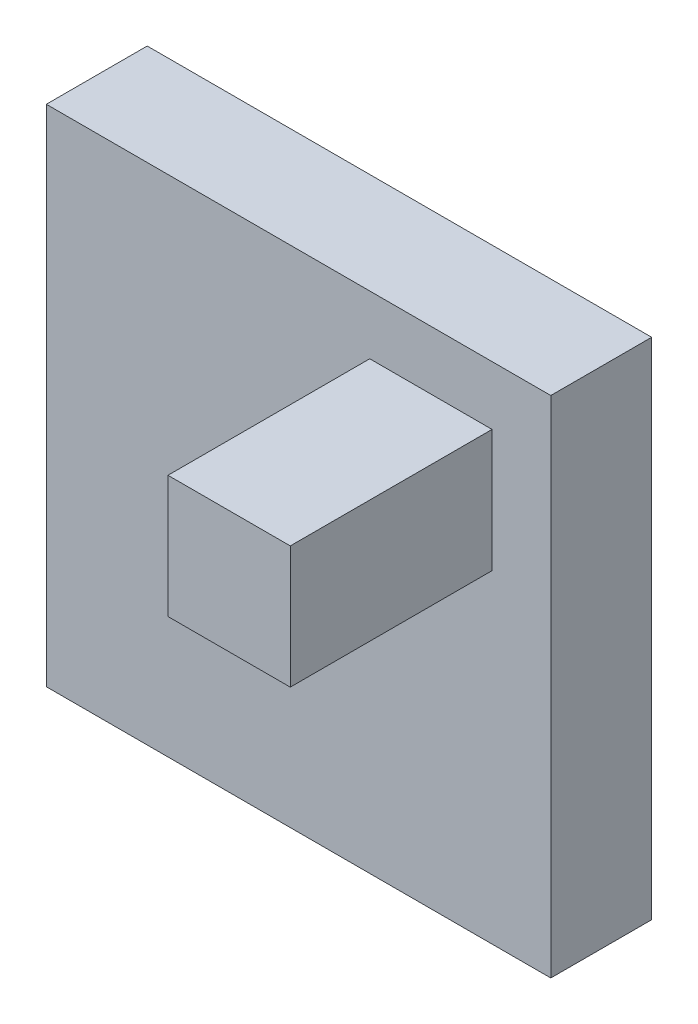
ISO-10303-21;
HEADER;
FILE_DESCRIPTION(('STEP AP214'),'2;1');
FILE_NAME('part.step','',(''),(''),'','','');
FILE_SCHEMA(('AUTOMOTIVE_DESIGN { 1 0 10303 214 1 1 1 1 }'));
ENDSEC;
DATA;
#1=APPLICATION_CONTEXT('core data for automotive mechanical design processes');
#2=APPLICATION_PROTOCOL_DEFINITION('international standard','automotive_design',2000,#1);
#3=PRODUCT_CONTEXT('',#1,'mechanical');
#4=PRODUCT('Part','Part','',(#3));
#5=PRODUCT_RELATED_PRODUCT_CATEGORY('part','',(#4));
#6=PRODUCT_DEFINITION_FORMATION('','',#4);
#7=PRODUCT_DEFINITION_CONTEXT('part definition',#1,'design');
#8=PRODUCT_DEFINITION('design','',#6,#7);
#9=PRODUCT_DEFINITION_SHAPE('','',#8);
#10=(LENGTH_UNIT() NAMED_UNIT(*) SI_UNIT(.MILLI.,.METRE.));
#11=(NAMED_UNIT(*) PLANE_ANGLE_UNIT() SI_UNIT($,.RADIAN.));
#12=(NAMED_UNIT(*) SI_UNIT($,.STERADIAN.) SOLID_ANGLE_UNIT());
#13=UNCERTAINTY_MEASURE_WITH_UNIT(LENGTH_MEASURE(1.E-05),#10,'distance_accuracy_value','');
#14=(GEOMETRIC_REPRESENTATION_CONTEXT(3) GLOBAL_UNCERTAINTY_ASSIGNED_CONTEXT((#13)) GLOBAL_UNIT_ASSIGNED_CONTEXT((#10,
#11,#12)) REPRESENTATION_CONTEXT('',''));
#15=CARTESIAN_POINT('',(0.,0.,0.));
#16=DIRECTION('',(0.,0.,1.));
#17=DIRECTION('',(1.,0.,0.));
#18=AXIS2_PLACEMENT_3D('',#15,#16,#17);
#19=CARTESIAN_POINT('',(0.,0.,2.));
#20=DIRECTION('',(0.,0.,1.));
#21=DIRECTION('',(1.,0.,0.));
#22=AXIS2_PLACEMENT_3D('',#19,#20,#21);
#23=PLANE('',#22);
#24=DIRECTION('',(0.,-1.,0.));
#25=VECTOR('',#24,1.);
#26=CARTESIAN_POINT('',(0.,0.,2.));
#27=LINE('',#26,#25);
#28=CARTESIAN_POINT('',(0.,0.,2.));
#29=VERTEX_POINT('',#28);
#30=CARTESIAN_POINT('',(0.,-10.,2.));
#31=VERTEX_POINT('',#30);
#32=EDGE_CURVE('E156',#29,#31,#27,.T.);
#33=ORIENTED_EDGE('',*,*,#32,.T.);
#34=DIRECTION('',(1.,0.,0.));
#35=VECTOR('',#34,1.);
#36=CARTESIAN_POINT('',(0.,-10.,2.));
#37=LINE('',#36,#35);
#38=CARTESIAN_POINT('',(10.,-10.,2.));
#39=VERTEX_POINT('',#38);
#40=EDGE_CURVE('E96',#31,#39,#37,.T.);
#41=ORIENTED_EDGE('',*,*,#40,.T.);
#42=DIRECTION('',(0.,1.,0.));
#43=VECTOR('',#42,1.);
#44=CARTESIAN_POINT('',(10.,0.,2.));
#45=LINE('',#44,#43);
#46=CARTESIAN_POINT('',(10.,0.,2.));
#47=VERTEX_POINT('',#46);
#48=EDGE_CURVE('E161',#39,#47,#45,.T.);
#49=ORIENTED_EDGE('',*,*,#48,.T.);
#50=DIRECTION('',(-1.,0.,0.));
#51=VECTOR('',#50,1.);
#52=CARTESIAN_POINT('',(0.,0.,2.));
#53=LINE('',#52,#51);
#54=EDGE_CURVE('E68',#47,#29,#53,.T.);
#55=ORIENTED_EDGE('',*,*,#54,.T.);
#56=EDGE_LOOP('',(#33,#41,#49,#55));
#57=FACE_BOUND('',#56,.T.);
#58=DIRECTION('',(1.,0.,0.));
#59=VECTOR('',#58,1.);
#60=CARTESIAN_POINT('',(6.41133202771353,-3.58866797228647,2.));
#61=LINE('',#60,#59);
#62=CARTESIAN_POINT('',(6.41133202771353,-3.58866797228647,2.));
#63=VERTEX_POINT('',#62);
#64=CARTESIAN_POINT('',(8.8360641204394,-3.58866797228647,2.));
#65=VERTEX_POINT('',#64);
#66=EDGE_CURVE('E313',#63,#65,#61,.T.);
#67=ORIENTED_EDGE('',*,*,#66,.F.);
#68=DIRECTION('',(0.,-1.,0.));
#69=VECTOR('',#68,1.);
#70=CARTESIAN_POINT('',(6.41133202771353,-1.16393587956059,2.));
#71=LINE('',#70,#69);
#72=CARTESIAN_POINT('',(6.41133202771353,-1.16393587956059,2.));
#73=VERTEX_POINT('',#72);
#74=EDGE_CURVE('E143',#73,#63,#71,.T.);
#75=ORIENTED_EDGE('',*,*,#74,.F.);
#76=DIRECTION('',(-1.,0.,0.));
#77=VECTOR('',#76,1.);
#78=CARTESIAN_POINT('',(6.41133202771353,-1.16393587956059,2.));
#79=LINE('',#78,#77);
#80=CARTESIAN_POINT('',(8.8360641204394,-1.16393587956059,2.));
#81=VERTEX_POINT('',#80);
#82=EDGE_CURVE('E139',#81,#73,#79,.T.);
#83=ORIENTED_EDGE('',*,*,#82,.F.);
#84=DIRECTION('',(0.,1.,0.));
#85=VECTOR('',#84,1.);
#86=CARTESIAN_POINT('',(8.8360641204394,-1.16393587956059,2.));
#87=LINE('',#86,#85);
#88=EDGE_CURVE('E309',#65,#81,#87,.T.);
#89=ORIENTED_EDGE('',*,*,#88,.F.);
#90=EDGE_LOOP('',(#67,#75,#83,#89));
#91=FACE_BOUND('',#90,.T.);
#92=ADVANCED_FACE('F43',(#57,#91),#23,.T.);
#93=CARTESIAN_POINT('',(0.,0.,2.));
#94=DIRECTION('',(1.,0.,0.));
#95=DIRECTION('',(0.,0.,-1.));
#96=AXIS2_PLACEMENT_3D('',#93,#94,#95);
#97=PLANE('',#96);
#98=DIRECTION('',(0.,-1.,0.));
#99=VECTOR('',#98,1.);
#100=CARTESIAN_POINT('',(0.,0.,0.));
#101=LINE('',#100,#99);
#102=CARTESIAN_POINT('',(0.,0.,0.));
#103=VERTEX_POINT('',#102);
#104=CARTESIAN_POINT('',(0.,-10.,0.));
#105=VERTEX_POINT('',#104);
#106=EDGE_CURVE('E146',#103,#105,#101,.T.);
#107=ORIENTED_EDGE('',*,*,#106,.T.);
#108=DIRECTION('',(0.,0.,-1.));
#109=VECTOR('',#108,1.);
#110=CARTESIAN_POINT('',(0.,-10.,2.));
#111=LINE('',#110,#109);
#112=EDGE_CURVE('E11',#31,#105,#111,.T.);
#113=ORIENTED_EDGE('',*,*,#112,.F.);
#114=ORIENTED_EDGE('',*,*,#32,.F.);
#115=DIRECTION('',(0.,0.,-1.));
#116=VECTOR('',#115,1.);
#117=CARTESIAN_POINT('',(0.,0.,2.));
#118=LINE('',#117,#116);
#119=EDGE_CURVE('E165',#29,#103,#118,.T.);
#120=ORIENTED_EDGE('',*,*,#119,.T.);
#121=EDGE_LOOP('',(#107,#113,#114,#120));
#122=FACE_BOUND('',#121,.T.);
#123=ADVANCED_FACE('F45',(#122),#97,.F.);
#124=CARTESIAN_POINT('',(0.,-10.,2.));
#125=DIRECTION('',(0.,1.,0.));
#126=DIRECTION('',(0.,0.,1.));
#127=AXIS2_PLACEMENT_3D('',#124,#125,#126);
#128=PLANE('',#127);
#129=DIRECTION('',(1.,0.,0.));
#130=VECTOR('',#129,1.);
#131=CARTESIAN_POINT('',(0.,-10.,0.));
#132=LINE('',#131,#130);
#133=CARTESIAN_POINT('',(10.,-10.,0.));
#134=VERTEX_POINT('',#133);
#135=EDGE_CURVE('E151',#105,#134,#132,.T.);
#136=ORIENTED_EDGE('',*,*,#135,.T.);
#137=DIRECTION('',(0.,0.,-1.));
#138=VECTOR('',#137,1.);
#139=CARTESIAN_POINT('',(10.,-10.,2.));
#140=LINE('',#139,#138);
#141=EDGE_CURVE('E52',#39,#134,#140,.T.);
#142=ORIENTED_EDGE('',*,*,#141,.F.);
#143=ORIENTED_EDGE('',*,*,#40,.F.);
#144=ORIENTED_EDGE('',*,*,#112,.T.);
#145=EDGE_LOOP('',(#136,#142,#143,#144));
#146=FACE_BOUND('',#145,.T.);
#147=ADVANCED_FACE('F199',(#146),#128,.F.);
#148=CARTESIAN_POINT('',(10.,0.,2.));
#149=DIRECTION('',(-1.,0.,0.));
#150=DIRECTION('',(0.,0.,1.));
#151=AXIS2_PLACEMENT_3D('',#148,#149,#150);
#152=PLANE('',#151);
#153=DIRECTION('',(0.,1.,0.));
#154=VECTOR('',#153,1.);
#155=CARTESIAN_POINT('',(10.,0.,0.));
#156=LINE('',#155,#154);
#157=CARTESIAN_POINT('',(10.,0.,0.));
#158=VERTEX_POINT('',#157);
#159=EDGE_CURVE('E169',#134,#158,#156,.T.);
#160=ORIENTED_EDGE('',*,*,#159,.T.);
#161=DIRECTION('',(0.,0.,-1.));
#162=VECTOR('',#161,1.);
#163=CARTESIAN_POINT('',(10.,0.,2.));
#164=LINE('',#163,#162);
#165=EDGE_CURVE('E176',#47,#158,#164,.T.);
#166=ORIENTED_EDGE('',*,*,#165,.F.);
#167=ORIENTED_EDGE('',*,*,#48,.F.);
#168=ORIENTED_EDGE('',*,*,#141,.T.);
#169=EDGE_LOOP('',(#160,#166,#167,#168));
#170=FACE_BOUND('',#169,.T.);
#171=ADVANCED_FACE('F183',(#170),#152,.F.);
#172=CARTESIAN_POINT('',(0.,0.,2.));
#173=DIRECTION('',(0.,-1.,0.));
#174=DIRECTION('',(0.,0.,-1.));
#175=AXIS2_PLACEMENT_3D('',#172,#173,#174);
#176=PLANE('',#175);
#177=DIRECTION('',(-1.,0.,0.));
#178=VECTOR('',#177,1.);
#179=CARTESIAN_POINT('',(0.,0.,0.));
#180=LINE('',#179,#178);
#181=EDGE_CURVE('E89',#158,#103,#180,.T.);
#182=ORIENTED_EDGE('',*,*,#181,.T.);
#183=ORIENTED_EDGE('',*,*,#119,.F.);
#184=ORIENTED_EDGE('',*,*,#54,.F.);
#185=ORIENTED_EDGE('',*,*,#165,.T.);
#186=EDGE_LOOP('',(#182,#183,#184,#185));
#187=FACE_BOUND('',#186,.T.);
#188=ADVANCED_FACE('F191',(#187),#176,.F.);
#189=CARTESIAN_POINT('',(0.,0.,0.));
#190=DIRECTION('',(0.,0.,1.));
#191=DIRECTION('',(1.,0.,0.));
#192=AXIS2_PLACEMENT_3D('',#189,#190,#191);
#193=PLANE('',#192);
#194=ORIENTED_EDGE('',*,*,#106,.F.);
#195=ORIENTED_EDGE('',*,*,#181,.F.);
#196=ORIENTED_EDGE('',*,*,#159,.F.);
#197=ORIENTED_EDGE('',*,*,#135,.F.);
#198=EDGE_LOOP('',(#194,#195,#196,#197));
#199=FACE_BOUND('',#198,.T.);
#200=ADVANCED_FACE('F187',(#199),#193,.F.);
#201=CARTESIAN_POINT('',(6.41133202771353,-1.16393587956059,6.));
#202=DIRECTION('',(1.,0.,0.));
#203=DIRECTION('',(0.,1.,0.));
#204=AXIS2_PLACEMENT_3D('',#201,#202,#203);
#205=PLANE('',#204);
#206=ORIENTED_EDGE('',*,*,#74,.T.);
#207=DIRECTION('',(0.,0.,-1.));
#208=VECTOR('',#207,1.);
#209=CARTESIAN_POINT('',(6.41133202771353,-3.58866797228647,6.));
#210=LINE('',#209,#208);
#211=CARTESIAN_POINT('',(6.41133202771353,-3.58866797228647,6.));
#212=VERTEX_POINT('',#211);
#213=EDGE_CURVE('E122',#212,#63,#210,.T.);
#214=ORIENTED_EDGE('',*,*,#213,.F.);
#215=DIRECTION('',(0.,-1.,0.));
#216=VECTOR('',#215,1.);
#217=CARTESIAN_POINT('',(6.41133202771353,-1.16393587956059,6.));
#218=LINE('',#217,#216);
#219=CARTESIAN_POINT('',(6.41133202771353,-1.16393587956059,6.));
#220=VERTEX_POINT('',#219);
#221=EDGE_CURVE('E130',#220,#212,#218,.T.);
#222=ORIENTED_EDGE('',*,*,#221,.F.);
#223=DIRECTION('',(0.,0.,-1.));
#224=VECTOR('',#223,1.);
#225=CARTESIAN_POINT('',(6.41133202771353,-1.16393587956059,6.));
#226=LINE('',#225,#224);
#227=EDGE_CURVE('E306',#220,#73,#226,.T.);
#228=ORIENTED_EDGE('',*,*,#227,.T.);
#229=EDGE_LOOP('',(#206,#214,#222,#228));
#230=FACE_BOUND('',#229,.T.);
#231=ADVANCED_FACE('F141',(#230),#205,.F.);
#232=CARTESIAN_POINT('',(6.41133202771353,-3.58866797228647,6.));
#233=DIRECTION('',(0.,1.,0.));
#234=DIRECTION('',(0.,0.,1.));
#235=AXIS2_PLACEMENT_3D('',#232,#233,#234);
#236=PLANE('',#235);
#237=ORIENTED_EDGE('',*,*,#66,.T.);
#238=DIRECTION('',(0.,0.,-1.));
#239=VECTOR('',#238,1.);
#240=CARTESIAN_POINT('',(8.8360641204394,-3.58866797228647,6.));
#241=LINE('',#240,#239);
#242=CARTESIAN_POINT('',(8.8360641204394,-3.58866797228647,6.));
#243=VERTEX_POINT('',#242);
#244=EDGE_CURVE('E125',#243,#65,#241,.T.);
#245=ORIENTED_EDGE('',*,*,#244,.F.);
#246=DIRECTION('',(1.,0.,0.));
#247=VECTOR('',#246,1.);
#248=CARTESIAN_POINT('',(6.41133202771353,-3.58866797228647,6.));
#249=LINE('',#248,#247);
#250=EDGE_CURVE('E118',#212,#243,#249,.T.);
#251=ORIENTED_EDGE('',*,*,#250,.F.);
#252=ORIENTED_EDGE('',*,*,#213,.T.);
#253=EDGE_LOOP('',(#237,#245,#251,#252));
#254=FACE_BOUND('',#253,.T.);
#255=ADVANCED_FACE('F120',(#254),#236,.F.);
#256=CARTESIAN_POINT('',(8.8360641204394,-1.16393587956059,6.));
#257=DIRECTION('',(-1.,0.,0.));
#258=DIRECTION('',(0.,0.,1.));
#259=AXIS2_PLACEMENT_3D('',#256,#257,#258);
#260=PLANE('',#259);
#261=ORIENTED_EDGE('',*,*,#88,.T.);
#262=DIRECTION('',(0.,0.,-1.));
#263=VECTOR('',#262,1.);
#264=CARTESIAN_POINT('',(8.8360641204394,-1.16393587956059,6.));
#265=LINE('',#264,#263);
#266=CARTESIAN_POINT('',(8.8360641204394,-1.16393587956059,6.));
#267=VERTEX_POINT('',#266);
#268=EDGE_CURVE('E59',#267,#81,#265,.T.);
#269=ORIENTED_EDGE('',*,*,#268,.F.);
#270=DIRECTION('',(0.,1.,0.));
#271=VECTOR('',#270,1.);
#272=CARTESIAN_POINT('',(8.8360641204394,-1.16393587956059,6.));
#273=LINE('',#272,#271);
#274=EDGE_CURVE('E129',#243,#267,#273,.T.);
#275=ORIENTED_EDGE('',*,*,#274,.F.);
#276=ORIENTED_EDGE('',*,*,#244,.T.);
#277=EDGE_LOOP('',(#261,#269,#275,#276));
#278=FACE_BOUND('',#277,.T.);
#279=ADVANCED_FACE('F212',(#278),#260,.F.);
#280=CARTESIAN_POINT('',(6.41133202771353,-1.16393587956059,6.));
#281=DIRECTION('',(0.,-1.,0.));
#282=DIRECTION('',(0.,0.,-1.));
#283=AXIS2_PLACEMENT_3D('',#280,#281,#282);
#284=PLANE('',#283);
#285=ORIENTED_EDGE('',*,*,#82,.T.);
#286=ORIENTED_EDGE('',*,*,#227,.F.);
#287=DIRECTION('',(-1.,0.,0.));
#288=VECTOR('',#287,1.);
#289=CARTESIAN_POINT('',(6.41133202771353,-1.16393587956059,6.));
#290=LINE('',#289,#288);
#291=EDGE_CURVE('E134',#267,#220,#290,.T.);
#292=ORIENTED_EDGE('',*,*,#291,.F.);
#293=ORIENTED_EDGE('',*,*,#268,.T.);
#294=EDGE_LOOP('',(#285,#286,#292,#293));
#295=FACE_BOUND('',#294,.T.);
#296=ADVANCED_FACE('F215',(#295),#284,.F.);
#297=CARTESIAN_POINT('',(0.,0.,6.));
#298=DIRECTION('',(0.,0.,1.));
#299=DIRECTION('',(1.,0.,0.));
#300=AXIS2_PLACEMENT_3D('',#297,#298,#299);
#301=PLANE('',#300);
#302=ORIENTED_EDGE('',*,*,#221,.T.);
#303=ORIENTED_EDGE('',*,*,#250,.T.);
#304=ORIENTED_EDGE('',*,*,#274,.T.);
#305=ORIENTED_EDGE('',*,*,#291,.T.);
#306=EDGE_LOOP('',(#302,#303,#304,#305));
#307=FACE_BOUND('',#306,.T.);
#308=ADVANCED_FACE('F133',(#307),#301,.T.);
#309=CLOSED_SHELL('',(#92,#123,#147,#171,#188,#200,#231,#255,#279,#296,#308));
#310=MANIFOLD_SOLID_BREP('B2',#309);
#311=ADVANCED_BREP_SHAPE_REPRESENTATION('',(#18,#310),#14);
#312=SHAPE_DEFINITION_REPRESENTATION(#9,#311);
ENDSEC;
END-ISO-10303-21;
